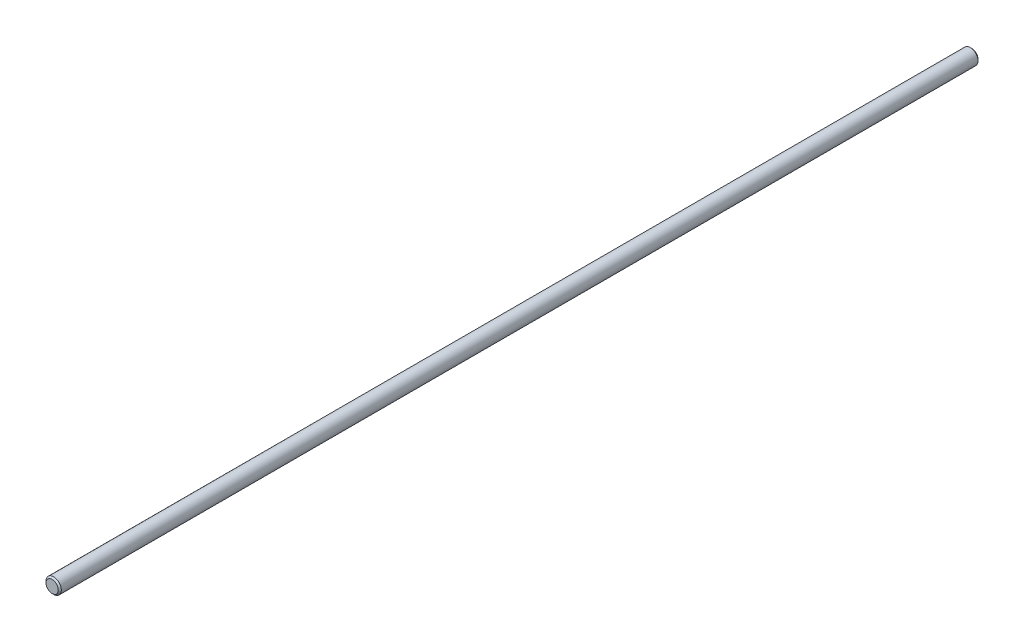
ISO-10303-21;
HEADER;
FILE_DESCRIPTION(('STEP AP214'),'2;1');
FILE_NAME('part.step','',(''),(''),'','','');
FILE_SCHEMA(('AUTOMOTIVE_DESIGN { 1 0 10303 214 1 1 1 1 }'));
ENDSEC;
DATA;
#1=APPLICATION_CONTEXT('core data for automotive mechanical design processes');
#2=APPLICATION_PROTOCOL_DEFINITION('international standard','automotive_design',2000,#1);
#3=PRODUCT_CONTEXT('',#1,'mechanical');
#4=PRODUCT('Part','Part','',(#3));
#5=PRODUCT_RELATED_PRODUCT_CATEGORY('part','',(#4));
#6=PRODUCT_DEFINITION_FORMATION('','',#4);
#7=PRODUCT_DEFINITION_CONTEXT('part definition',#1,'design');
#8=PRODUCT_DEFINITION('design','',#6,#7);
#9=PRODUCT_DEFINITION_SHAPE('','',#8);
#10=(LENGTH_UNIT() NAMED_UNIT(*) SI_UNIT(.MILLI.,.METRE.));
#11=(NAMED_UNIT(*) PLANE_ANGLE_UNIT() SI_UNIT($,.RADIAN.));
#12=(NAMED_UNIT(*) SI_UNIT($,.STERADIAN.) SOLID_ANGLE_UNIT());
#13=UNCERTAINTY_MEASURE_WITH_UNIT(LENGTH_MEASURE(1.E-05),#10,'distance_accuracy_value','');
#14=(GEOMETRIC_REPRESENTATION_CONTEXT(3) GLOBAL_UNCERTAINTY_ASSIGNED_CONTEXT((#13)) GLOBAL_UNIT_ASSIGNED_CONTEXT((#10,
#11,#12)) REPRESENTATION_CONTEXT('',''));
#15=CARTESIAN_POINT('',(0.,0.,0.));
#16=DIRECTION('',(0.,0.,1.));
#17=DIRECTION('',(1.,0.,0.));
#18=AXIS2_PLACEMENT_3D('',#15,#16,#17);
#19=CARTESIAN_POINT('',(0.,0.,600.));
#20=DIRECTION('',(0.,0.,-1.));
#21=DIRECTION('',(-1.,0.,0.));
#22=AXIS2_PLACEMENT_3D('',#19,#20,#21);
#23=CYLINDRICAL_SURFACE('',#22,10.);
#24=CARTESIAN_POINT('',(0.,0.,-598.));
#25=DIRECTION('',(0.,0.,1.));
#26=DIRECTION('',(1.,0.,0.));
#27=AXIS2_PLACEMENT_3D('',#24,#25,#26);
#28=CIRCLE('',#27,10.);
#29=CARTESIAN_POINT('',(10.,0.,-598.));
#30=VERTEX_POINT('',#29);
#31=EDGE_CURVE('E43',#30,#30,#28,.T.);
#32=ORIENTED_EDGE('',*,*,#31,.T.);
#33=EDGE_LOOP('',(#32));
#34=FACE_BOUND('',#33,.T.);
#35=CARTESIAN_POINT('',(0.,0.,598.));
#36=DIRECTION('',(0.,0.,1.));
#37=DIRECTION('',(1.,0.,0.));
#38=AXIS2_PLACEMENT_3D('',#35,#36,#37);
#39=CIRCLE('',#38,10.);
#40=CARTESIAN_POINT('',(10.,0.,598.));
#41=VERTEX_POINT('',#40);
#42=EDGE_CURVE('E47',#41,#41,#39,.F.);
#43=ORIENTED_EDGE('',*,*,#42,.T.);
#44=EDGE_LOOP('',(#43));
#45=FACE_BOUND('',#44,.T.);
#46=ADVANCED_FACE('F32',(#34,#45),#23,.T.);
#47=CARTESIAN_POINT('',(0.,0.,600.));
#48=DIRECTION('',(0.,0.,1.));
#49=DIRECTION('',(1.,0.,0.));
#50=AXIS2_PLACEMENT_3D('',#47,#48,#49);
#51=PLANE('',#50);
#52=CARTESIAN_POINT('',(0.,0.,600.));
#53=DIRECTION('',(0.,0.,1.));
#54=DIRECTION('',(1.,0.,0.));
#55=AXIS2_PLACEMENT_3D('',#52,#53,#54);
#56=CIRCLE('',#55,8.00000000000034);
#57=CARTESIAN_POINT('',(8.00000000000034,0.,600.));
#58=VERTEX_POINT('',#57);
#59=EDGE_CURVE('E10',#58,#58,#56,.T.);
#60=ORIENTED_EDGE('',*,*,#59,.T.);
#61=EDGE_LOOP('',(#60));
#62=FACE_BOUND('',#61,.T.);
#63=ADVANCED_FACE('F63',(#62),#51,.T.);
#64=CARTESIAN_POINT('',(0.,0.,-600.));
#65=DIRECTION('',(0.,0.,1.));
#66=DIRECTION('',(1.,0.,0.));
#67=AXIS2_PLACEMENT_3D('',#64,#65,#66);
#68=PLANE('',#67);
#69=CARTESIAN_POINT('',(0.,0.,-600.));
#70=DIRECTION('',(0.,0.,1.));
#71=DIRECTION('',(1.,0.,0.));
#72=AXIS2_PLACEMENT_3D('',#69,#70,#71);
#73=CIRCLE('',#72,7.99999999999979);
#74=CARTESIAN_POINT('',(7.99999999999979,0.,-600.));
#75=VERTEX_POINT('',#74);
#76=EDGE_CURVE('E39',#75,#75,#73,.F.);
#77=ORIENTED_EDGE('',*,*,#76,.T.);
#78=EDGE_LOOP('',(#77));
#79=FACE_BOUND('',#78,.T.);
#80=ADVANCED_FACE('F60',(#79),#68,.F.);
#81=CARTESIAN_POINT('',(0.,0.,-598.));
#82=DIRECTION('',(0.,0.,1.));
#83=DIRECTION('',(1.,0.,0.));
#84=AXIS2_PLACEMENT_3D('',#81,#82,#83);
#85=CONICAL_SURFACE('',#84,10.,0.785398163397502);
#86=ORIENTED_EDGE('',*,*,#76,.F.);
#87=EDGE_LOOP('',(#86));
#88=FACE_BOUND('',#87,.T.);
#89=ORIENTED_EDGE('',*,*,#31,.F.);
#90=EDGE_LOOP('',(#89));
#91=FACE_BOUND('',#90,.T.);
#92=ADVANCED_FACE('F56',(#88,#91),#85,.T.);
#93=CARTESIAN_POINT('',(0.,0.,600.));
#94=DIRECTION('',(0.,0.,-1.));
#95=DIRECTION('',(-1.,0.,0.));
#96=AXIS2_PLACEMENT_3D('',#93,#94,#95);
#97=CONICAL_SURFACE('',#96,8.00000000000034,0.785398163397418);
#98=ORIENTED_EDGE('',*,*,#42,.F.);
#99=EDGE_LOOP('',(#98));
#100=FACE_BOUND('',#99,.T.);
#101=ORIENTED_EDGE('',*,*,#59,.F.);
#102=EDGE_LOOP('',(#101));
#103=FACE_BOUND('',#102,.T.);
#104=ADVANCED_FACE('F34',(#100,#103),#97,.T.);
#105=CLOSED_SHELL('',(#46,#63,#80,#92,#104));
#106=MANIFOLD_SOLID_BREP('B2',#105);
#107=ADVANCED_BREP_SHAPE_REPRESENTATION('',(#18,#106),#14);
#108=SHAPE_DEFINITION_REPRESENTATION(#9,#107);
ENDSEC;
END-ISO-10303-21;
